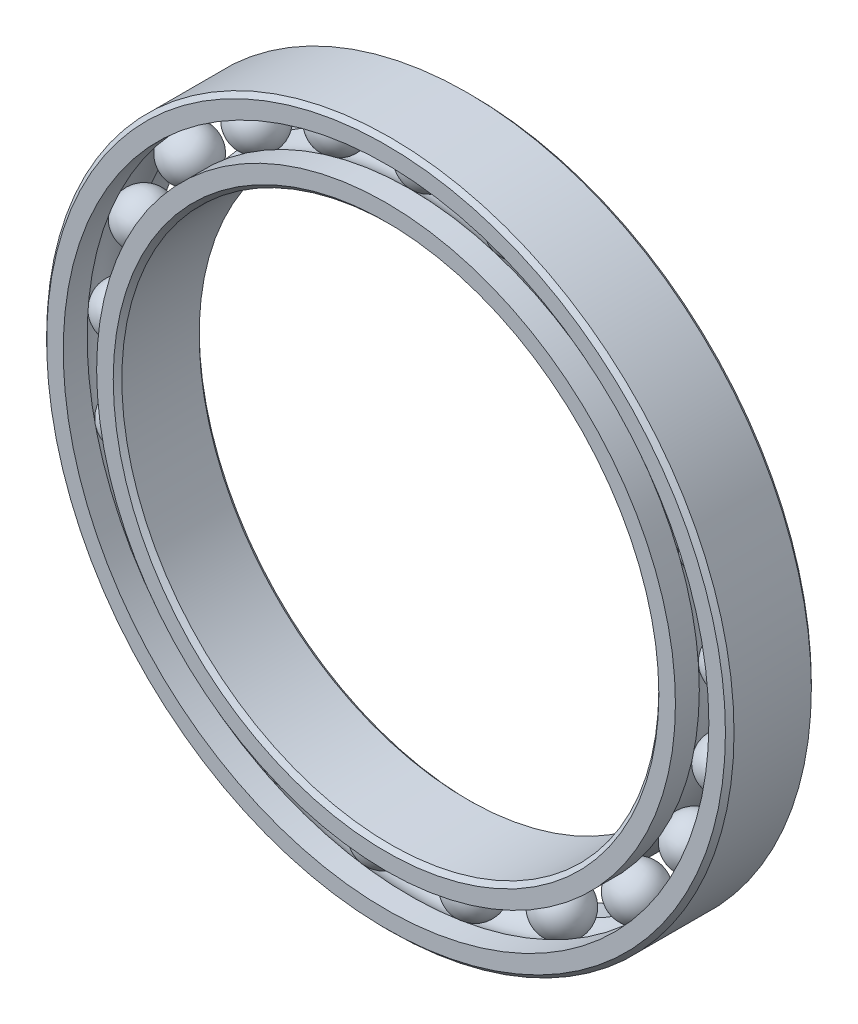
ISO-10303-21;
HEADER;
FILE_DESCRIPTION(('STEP AP214'),'2;1');
FILE_NAME('part.step','',(''),(''),'','','');
FILE_SCHEMA(('AUTOMOTIVE_DESIGN { 1 0 10303 214 1 1 1 1 }'));
ENDSEC;
DATA;
#1=APPLICATION_CONTEXT('core data for automotive mechanical design processes');
#2=APPLICATION_PROTOCOL_DEFINITION('international standard','automotive_design',2000,#1);
#3=PRODUCT_CONTEXT('',#1,'mechanical');
#4=PRODUCT('Part','Part','',(#3));
#5=PRODUCT_RELATED_PRODUCT_CATEGORY('part','',(#4));
#6=PRODUCT_DEFINITION_FORMATION('','',#4);
#7=PRODUCT_DEFINITION_CONTEXT('part definition',#1,'design');
#8=PRODUCT_DEFINITION('design','',#6,#7);
#9=PRODUCT_DEFINITION_SHAPE('','',#8);
#10=(LENGTH_UNIT() NAMED_UNIT(*) SI_UNIT(.MILLI.,.METRE.));
#11=(NAMED_UNIT(*) PLANE_ANGLE_UNIT() SI_UNIT($,.RADIAN.));
#12=(NAMED_UNIT(*) SI_UNIT($,.STERADIAN.) SOLID_ANGLE_UNIT());
#13=UNCERTAINTY_MEASURE_WITH_UNIT(LENGTH_MEASURE(1.E-05),#10,'distance_accuracy_value','');
#14=(GEOMETRIC_REPRESENTATION_CONTEXT(3) GLOBAL_UNCERTAINTY_ASSIGNED_CONTEXT((#13)) GLOBAL_UNIT_ASSIGNED_CONTEXT((#10,
#11,#12)) REPRESENTATION_CONTEXT('',''));
#15=CARTESIAN_POINT('',(0.,0.,0.));
#16=DIRECTION('',(0.,0.,1.));
#17=DIRECTION('',(1.,0.,0.));
#18=AXIS2_PLACEMENT_3D('',#15,#16,#17);
#19=CARTESIAN_POINT('',(4.2002612353552,13.6169124824526,0.));
#20=DIRECTION('',(0.,0.,1.));
#21=DIRECTION('',(0.294755174410891,0.955572805786145,0.));
#22=AXIS2_PLACEMENT_3D('',#19,#20,#21);
#23=SPHERICAL_SURFACE('',#22,1.18112731252607);
#24=CARTESIAN_POINT('',(4.2002612353552,13.6169124824526,1.18112731252607));
#25=VERTEX_POINT('',#24);
#26=VERTEX_LOOP('',#25);
#27=FACE_BOUND('',#26,.T.);
#28=ADVANCED_FACE('F42',(#27),#23,.T.);
#29=CLOSED_SHELL('',(#28));
#30=MANIFOLD_SOLID_BREP('B2',#29);
#31=CARTESIAN_POINT('',(8.02731082740647,11.773902534003,0.));
#32=DIRECTION('',(0.,0.,1.));
#33=DIRECTION('',(0.563320058063612,0.826238774316002,0.));
#34=AXIS2_PLACEMENT_3D('',#31,#32,#33);
#35=SPHERICAL_SURFACE('',#34,1.18112731252607);
#36=CARTESIAN_POINT('',(8.02731082740647,11.773902534003,1.18112731252607));
#37=VERTEX_POINT('',#36);
#38=VERTEX_LOOP('',#37);
#39=FACE_BOUND('',#38,.T.);
#40=ADVANCED_FACE('F61',(#39),#35,.T.);
#41=CLOSED_SHELL('',(#40));
#42=MANIFOLD_SOLID_BREP('B6',#41);
#43=CARTESIAN_POINT('',(11.1410986251693,8.88472967648709,0.));
#44=DIRECTION('',(0.,0.,1.));
#45=DIRECTION('',(0.781831482468022,0.623489801858743,0.));
#46=AXIS2_PLACEMENT_3D('',#43,#44,#45);
#47=SPHERICAL_SURFACE('',#46,1.18112731252607);
#48=CARTESIAN_POINT('',(11.1410986251693,8.88472967648709,1.18112731252607));
#49=VERTEX_POINT('',#48);
#50=VERTEX_LOOP('',#49);
#51=FACE_BOUND('',#50,.T.);
#52=ADVANCED_FACE('F80',(#51),#47,.T.);
#53=CLOSED_SHELL('',(#52));
#54=MANIFOLD_SOLID_BREP('B38',#53);
#55=CARTESIAN_POINT('',(13.2649509181799,5.20610959722128,0.));
#56=DIRECTION('',(0.,0.,1.));
#57=DIRECTION('',(0.9308737486442,0.365341024366405,0.));
#58=AXIS2_PLACEMENT_3D('',#55,#56,#57);
#59=SPHERICAL_SURFACE('',#58,1.18112731252607);
#60=CARTESIAN_POINT('',(13.2649509181799,5.20610959722128,1.18112731252607));
#61=VERTEX_POINT('',#60);
#62=VERTEX_LOOP('',#61);
#63=FACE_BOUND('',#62,.T.);
#64=ADVANCED_FACE('F99',(#63),#59,.T.);
#65=CLOSED_SHELL('',(#64));
#66=MANIFOLD_SOLID_BREP('B57',#65);
#67=CARTESIAN_POINT('',(14.2101541098318,1.0649038336067,0.));
#68=DIRECTION('',(0.,0.,1.));
#69=DIRECTION('',(0.997203797181179,0.074730093586435,0.));
#70=AXIS2_PLACEMENT_3D('',#67,#68,#69);
#71=SPHERICAL_SURFACE('',#70,1.18112731252607);
#72=CARTESIAN_POINT('',(14.2101541098318,1.0649038336067,1.18112731252607));
#73=VERTEX_POINT('',#72);
#74=VERTEX_LOOP('',#73);
#75=FACE_BOUND('',#74,.T.);
#76=ADVANCED_FACE('F120',(#75),#71,.T.);
#77=CLOSED_SHELL('',(#76));
#78=MANIFOLD_SOLID_BREP('B76',#77);
#79=CARTESIAN_POINT('',(13.892722748591,-3.17092330887733,0.));
#80=DIRECTION('',(0.,0.,1.));
#81=DIRECTION('',(0.974927912181826,-0.222520933956304,0.));
#82=AXIS2_PLACEMENT_3D('',#79,#80,#81);
#83=SPHERICAL_SURFACE('',#82,1.18112731252607);
#84=CARTESIAN_POINT('',(13.892722748591,-3.17092330887733,1.18112731252607));
#85=VERTEX_POINT('',#84);
#86=VERTEX_LOOP('',#85);
#87=FACE_BOUND('',#86,.T.);
#88=ADVANCED_FACE('F141',(#87),#83,.T.);
#89=CLOSED_SHELL('',(#88));
#90=MANIFOLD_SOLID_BREP('B95',#89);
#91=CARTESIAN_POINT('',(12.3408620039283,-7.12499999999989,0.));
#92=DIRECTION('',(0.,0.,1.));
#93=DIRECTION('',(0.866025403784443,-0.499999999999992,0.));
#94=AXIS2_PLACEMENT_3D('',#91,#92,#93);
#95=SPHERICAL_SURFACE('',#94,1.18112731252607);
#96=CARTESIAN_POINT('',(12.3408620039283,-7.12499999999989,1.18112731252607));
#97=VERTEX_POINT('',#96);
#98=VERTEX_LOOP('',#97);
#99=FACE_BOUND('',#98,.T.);
#100=ADVANCED_FACE('F162',(#99),#95,.T.);
#101=CLOSED_SHELL('',(#100));
#102=MANIFOLD_SOLID_BREP('B116',#101);
#103=CARTESIAN_POINT('',(9.69246151323569,-10.4459891735749,0.));
#104=DIRECTION('',(0.,0.,1.));
#105=DIRECTION('',(0.680172737770926,-0.73305187182982,0.));
#106=AXIS2_PLACEMENT_3D('',#103,#104,#105);
#107=SPHERICAL_SURFACE('',#106,1.18112731252607);
#108=CARTESIAN_POINT('',(9.69246151323569,-10.4459891735749,1.18112731252607));
#109=VERTEX_POINT('',#108);
#110=VERTEX_LOOP('',#109);
#111=FACE_BOUND('',#110,.T.);
#112=ADVANCED_FACE('F183',(#111),#107,.T.);
#113=CLOSED_SHELL('',(#112));
#114=MANIFOLD_SOLID_BREP('B137',#113);
#115=CARTESIAN_POINT('',(6.1828432824253,-12.8388063676094,0.));
#116=DIRECTION('',(0.,0.,1.));
#117=DIRECTION('',(0.433883739117565,-0.900968867902416,0.));
#118=AXIS2_PLACEMENT_3D('',#115,#116,#117);
#119=SPHERICAL_SURFACE('',#118,1.18112731252607);
#120=CARTESIAN_POINT('',(6.1828432824253,-12.8388063676094,1.18112731252607));
#121=VERTEX_POINT('',#120);
#122=VERTEX_LOOP('',#121);
#123=FACE_BOUND('',#122,.T.);
#124=ADVANCED_FACE('F204',(#123),#119,.T.);
#125=CLOSED_SHELL('',(#124));
#126=MANIFOLD_SOLID_BREP('B158',#125);
#127=CARTESIAN_POINT('',(2.12385229301059,-14.0908392737081,0.));
#128=DIRECTION('',(0.,0.,1.));
#129=DIRECTION('',(0.149042266176182,-0.988830826225127,0.));
#130=AXIS2_PLACEMENT_3D('',#127,#128,#129);
#131=SPHERICAL_SURFACE('',#130,1.18112731252607);
#132=CARTESIAN_POINT('',(2.12385229301059,-14.0908392737081,1.18112731252607));
#133=VERTEX_POINT('',#132);
#134=VERTEX_LOOP('',#133);
#135=FACE_BOUND('',#134,.T.);
#136=ADVANCED_FACE('F225',(#135),#131,.T.);
#137=CLOSED_SHELL('',(#136));
#138=MANIFOLD_SOLID_BREP('B179',#137);
#139=CARTESIAN_POINT('',(-2.12385229301039,-14.0908392737081,0.));
#140=DIRECTION('',(0.,0.,1.));
#141=DIRECTION('',(-0.149042266176168,-0.98883082622513,0.));
#142=AXIS2_PLACEMENT_3D('',#139,#140,#141);
#143=SPHERICAL_SURFACE('',#142,1.18112731252607);
#144=CARTESIAN_POINT('',(-2.12385229301039,-14.0908392737081,1.18112731252607));
#145=VERTEX_POINT('',#144);
#146=VERTEX_LOOP('',#145);
#147=FACE_BOUND('',#146,.T.);
#148=ADVANCED_FACE('F246',(#147),#143,.T.);
#149=CLOSED_SHELL('',(#148));
#150=MANIFOLD_SOLID_BREP('B200',#149);
#151=CARTESIAN_POINT('',(-6.18284328242513,-12.8388063676095,0.));
#152=DIRECTION('',(0.,0.,1.));
#153=DIRECTION('',(-0.433883739117553,-0.900968867902422,0.));
#154=AXIS2_PLACEMENT_3D('',#151,#152,#153);
#155=SPHERICAL_SURFACE('',#154,1.18112731252607);
#156=CARTESIAN_POINT('',(-6.18284328242513,-12.8388063676095,1.18112731252607));
#157=VERTEX_POINT('',#156);
#158=VERTEX_LOOP('',#157);
#159=FACE_BOUND('',#158,.T.);
#160=ADVANCED_FACE('F267',(#159),#155,.T.);
#161=CLOSED_SHELL('',(#160));
#162=MANIFOLD_SOLID_BREP('B221',#161);
#163=CARTESIAN_POINT('',(-9.69246151323555,-10.4459891735751,0.));
#164=DIRECTION('',(0.,0.,1.));
#165=DIRECTION('',(-0.680172737770915,-0.73305187182983,0.));
#166=AXIS2_PLACEMENT_3D('',#163,#164,#165);
#167=SPHERICAL_SURFACE('',#166,1.18112731252607);
#168=CARTESIAN_POINT('',(-9.69246151323555,-10.4459891735751,1.18112731252607));
#169=VERTEX_POINT('',#168);
#170=VERTEX_LOOP('',#169);
#171=FACE_BOUND('',#170,.T.);
#172=ADVANCED_FACE('F288',(#171),#167,.T.);
#173=CLOSED_SHELL('',(#172));
#174=MANIFOLD_SOLID_BREP('B242',#173);
#175=CARTESIAN_POINT('',(-12.3408620039282,-7.12500000000006,0.));
#176=DIRECTION('',(0.,0.,1.));
#177=DIRECTION('',(-0.866025403784436,-0.500000000000004,0.));
#178=AXIS2_PLACEMENT_3D('',#175,#176,#177);
#179=SPHERICAL_SURFACE('',#178,1.18112731252607);
#180=CARTESIAN_POINT('',(-12.3408620039282,-7.12500000000006,1.18112731252607));
#181=VERTEX_POINT('',#180);
#182=VERTEX_LOOP('',#181);
#183=FACE_BOUND('',#182,.T.);
#184=ADVANCED_FACE('F309',(#183),#179,.T.);
#185=CLOSED_SHELL('',(#184));
#186=MANIFOLD_SOLID_BREP('B263',#185);
#187=CARTESIAN_POINT('',(-13.892722748591,-3.17092330887754,0.));
#188=DIRECTION('',(0.,0.,1.));
#189=DIRECTION('',(-0.974927912181823,-0.222520933956318,0.));
#190=AXIS2_PLACEMENT_3D('',#187,#188,#189);
#191=SPHERICAL_SURFACE('',#190,1.18112731252607);
#192=CARTESIAN_POINT('',(-13.892722748591,-3.17092330887754,1.18112731252607));
#193=VERTEX_POINT('',#192);
#194=VERTEX_LOOP('',#193);
#195=FACE_BOUND('',#194,.T.);
#196=ADVANCED_FACE('F330',(#195),#191,.T.);
#197=CLOSED_SHELL('',(#196));
#198=MANIFOLD_SOLID_BREP('B284',#197);
#199=CARTESIAN_POINT('',(-14.2101541098318,1.0649038336065,0.));
#200=DIRECTION('',(0.,0.,1.));
#201=DIRECTION('',(-0.997203797181181,0.0747300935864209,0.));
#202=AXIS2_PLACEMENT_3D('',#199,#200,#201);
#203=SPHERICAL_SURFACE('',#202,1.18112731252607);
#204=CARTESIAN_POINT('',(-14.2101541098318,1.0649038336065,1.18112731252607));
#205=VERTEX_POINT('',#204);
#206=VERTEX_LOOP('',#205);
#207=FACE_BOUND('',#206,.T.);
#208=ADVANCED_FACE('F351',(#207),#203,.T.);
#209=CLOSED_SHELL('',(#208));
#210=MANIFOLD_SOLID_BREP('B305',#209);
#211=CARTESIAN_POINT('',(-13.2649509181799,5.20610959722109,0.));
#212=DIRECTION('',(0.,0.,1.));
#213=DIRECTION('',(-0.930873748644205,0.365341024366392,0.));
#214=AXIS2_PLACEMENT_3D('',#211,#212,#213);
#215=SPHERICAL_SURFACE('',#214,1.18112731252607);
#216=CARTESIAN_POINT('',(-13.2649509181799,5.20610959722109,1.18112731252607));
#217=VERTEX_POINT('',#216);
#218=VERTEX_LOOP('',#217);
#219=FACE_BOUND('',#218,.T.);
#220=ADVANCED_FACE('F372',(#219),#215,.T.);
#221=CLOSED_SHELL('',(#220));
#222=MANIFOLD_SOLID_BREP('B326',#221);
#223=CARTESIAN_POINT('',(-11.1410986251694,8.88472967648693,0.));
#224=DIRECTION('',(0.,0.,1.));
#225=DIRECTION('',(-0.781831482468031,0.623489801858732,0.));
#226=AXIS2_PLACEMENT_3D('',#223,#224,#225);
#227=SPHERICAL_SURFACE('',#226,1.18112731252607);
#228=CARTESIAN_POINT('',(-11.1410986251694,8.88472967648693,1.18112731252607));
#229=VERTEX_POINT('',#228);
#230=VERTEX_LOOP('',#229);
#231=FACE_BOUND('',#230,.T.);
#232=ADVANCED_FACE('F393',(#231),#227,.T.);
#233=CLOSED_SHELL('',(#232));
#234=MANIFOLD_SOLID_BREP('B347',#233);
#235=CARTESIAN_POINT('',(-8.02731082740663,11.7739025340029,0.));
#236=DIRECTION('',(0.,0.,1.));
#237=DIRECTION('',(-0.563320058063623,0.826238774315994,0.));
#238=AXIS2_PLACEMENT_3D('',#235,#236,#237);
#239=SPHERICAL_SURFACE('',#238,1.18112731252607);
#240=CARTESIAN_POINT('',(-8.02731082740663,11.7739025340029,1.18112731252607));
#241=VERTEX_POINT('',#240);
#242=VERTEX_LOOP('',#241);
#243=FACE_BOUND('',#242,.T.);
#244=ADVANCED_FACE('F414',(#243),#239,.T.);
#245=CLOSED_SHELL('',(#244));
#246=MANIFOLD_SOLID_BREP('B368',#245);
#247=CARTESIAN_POINT('',(-4.20026123535539,13.6169124824525,0.));
#248=DIRECTION('',(0.,0.,1.));
#249=DIRECTION('',(-0.294755174410905,0.955572805786141,0.));
#250=AXIS2_PLACEMENT_3D('',#247,#248,#249);
#251=SPHERICAL_SURFACE('',#250,1.18112731252607);
#252=CARTESIAN_POINT('',(-4.20026123535539,13.6169124824525,1.18112731252607));
#253=VERTEX_POINT('',#252);
#254=VERTEX_LOOP('',#253);
#255=FACE_BOUND('',#254,.T.);
#256=ADVANCED_FACE('F435',(#255),#251,.T.);
#257=CLOSED_SHELL('',(#256));
#258=MANIFOLD_SOLID_BREP('B389',#257);
#259=CARTESIAN_POINT('',(0.,14.25,0.));
#260=DIRECTION('',(0.,0.,1.));
#261=DIRECTION('',(0.,1.,0.));
#262=AXIS2_PLACEMENT_3D('',#259,#260,#261);
#263=SPHERICAL_SURFACE('',#262,1.18112731252607);
#264=CARTESIAN_POINT('',(0.,14.25,1.18112731252607));
#265=VERTEX_POINT('',#264);
#266=VERTEX_LOOP('',#265);
#267=FACE_BOUND('',#266,.T.);
#268=ADVANCED_FACE('F458',(#267),#263,.T.);
#269=CLOSED_SHELL('',(#268));
#270=MANIFOLD_SOLID_BREP('B410',#269);
#271=CARTESIAN_POINT('',(0.,13.4722222222222,2.));
#272=DIRECTION('',(0.,0.,-1.));
#273=DIRECTION('',(-1.,0.,0.));
#274=AXIS2_PLACEMENT_3D('',#271,#272,#273);
#275=PLANE('',#274);
#276=CARTESIAN_POINT('',(0.,0.,2.));
#277=DIRECTION('',(0.,0.,1.));
#278=DIRECTION('',(1.,0.,0.));
#279=AXIS2_PLACEMENT_3D('',#276,#277,#278);
#280=CIRCLE('',#279,12.7);
#281=CARTESIAN_POINT('',(12.7,0.,2.));
#282=VERTEX_POINT('',#281);
#283=EDGE_CURVE('E506',#282,#282,#280,.T.);
#284=ORIENTED_EDGE('',*,*,#283,.F.);
#285=EDGE_LOOP('',(#284));
#286=FACE_BOUND('',#285,.T.);
#287=CARTESIAN_POINT('',(0.,0.,2.));
#288=DIRECTION('',(0.,0.,1.));
#289=DIRECTION('',(1.,0.,0.));
#290=AXIS2_PLACEMENT_3D('',#287,#288,#289);
#291=CIRCLE('',#290,13.4722222222222);
#292=CARTESIAN_POINT('',(13.4722222222222,0.,2.));
#293=VERTEX_POINT('',#292);
#294=EDGE_CURVE('E457',#293,#293,#291,.T.);
#295=ORIENTED_EDGE('',*,*,#294,.T.);
#296=EDGE_LOOP('',(#295));
#297=FACE_BOUND('',#296,.T.);
#298=ADVANCED_FACE('F478',(#286,#297),#275,.F.);
#299=CARTESIAN_POINT('',(0.,0.,2.));
#300=DIRECTION('',(0.,0.,1.));
#301=DIRECTION('',(1.,0.,0.));
#302=AXIS2_PLACEMENT_3D('',#299,#300,#301);
#303=CYLINDRICAL_SURFACE('',#302,13.4722222222222);
#304=ORIENTED_EDGE('',*,*,#294,.F.);
#305=EDGE_LOOP('',(#304));
#306=FACE_BOUND('',#305,.T.);
#307=CARTESIAN_POINT('',(0.,0.,0.88888888888889));
#308=DIRECTION('',(0.,0.,1.));
#309=DIRECTION('',(1.,0.,0.));
#310=AXIS2_PLACEMENT_3D('',#307,#308,#309);
#311=CIRCLE('',#310,13.4722222222222);
#312=CARTESIAN_POINT('',(13.4722222222222,0.,0.88888888888889));
#313=VERTEX_POINT('',#312);
#314=EDGE_CURVE('E484',#313,#313,#311,.T.);
#315=ORIENTED_EDGE('',*,*,#314,.T.);
#316=EDGE_LOOP('',(#315));
#317=FACE_BOUND('',#316,.T.);
#318=ADVANCED_FACE('F513',(#306,#317),#303,.T.);
#319=CARTESIAN_POINT('',(0.,0.,0.));
#320=DIRECTION('',(0.,0.,1.));
#321=DIRECTION('',(1.,0.,0.));
#322=AXIS2_PLACEMENT_3D('',#319,#320,#321);
#323=TOROIDAL_SURFACE('',#322,14.25,1.18112731252607);
#324=ORIENTED_EDGE('',*,*,#314,.F.);
#325=EDGE_LOOP('',(#324));
#326=FACE_BOUND('',#325,.T.);
#327=CARTESIAN_POINT('',(0.,0.,-0.88888888888889));
#328=DIRECTION('',(0.,0.,1.));
#329=DIRECTION('',(1.,0.,0.));
#330=AXIS2_PLACEMENT_3D('',#327,#328,#329);
#331=CIRCLE('',#330,13.4722222222222);
#332=CARTESIAN_POINT('',(13.4722222222222,0.,-0.88888888888889));
#333=VERTEX_POINT('',#332);
#334=EDGE_CURVE('E488',#333,#333,#331,.T.);
#335=ORIENTED_EDGE('',*,*,#334,.T.);
#336=EDGE_LOOP('',(#335));
#337=FACE_BOUND('',#336,.T.);
#338=ADVANCED_FACE('F517',(#326,#337),#323,.F.);
#339=CARTESIAN_POINT('',(0.,0.,2.));
#340=DIRECTION('',(0.,0.,1.));
#341=DIRECTION('',(1.,0.,0.));
#342=AXIS2_PLACEMENT_3D('',#339,#340,#341);
#343=CYLINDRICAL_SURFACE('',#342,13.4722222222222);
#344=ORIENTED_EDGE('',*,*,#334,.F.);
#345=EDGE_LOOP('',(#344));
#346=FACE_BOUND('',#345,.T.);
#347=CARTESIAN_POINT('',(0.,0.,-2.));
#348=DIRECTION('',(0.,0.,1.));
#349=DIRECTION('',(1.,0.,0.));
#350=AXIS2_PLACEMENT_3D('',#347,#348,#349);
#351=CIRCLE('',#350,13.4722222222222);
#352=CARTESIAN_POINT('',(13.4722222222222,0.,-2.));
#353=VERTEX_POINT('',#352);
#354=EDGE_CURVE('E492',#353,#353,#351,.T.);
#355=ORIENTED_EDGE('',*,*,#354,.T.);
#356=EDGE_LOOP('',(#355));
#357=FACE_BOUND('',#356,.T.);
#358=ADVANCED_FACE('F522',(#346,#357),#343,.T.);
#359=CARTESIAN_POINT('',(0.,12.7,-2.));
#360=DIRECTION('',(0.,0.,1.));
#361=DIRECTION('',(1.,0.,0.));
#362=AXIS2_PLACEMENT_3D('',#359,#360,#361);
#363=PLANE('',#362);
#364=ORIENTED_EDGE('',*,*,#354,.F.);
#365=EDGE_LOOP('',(#364));
#366=FACE_BOUND('',#365,.T.);
#367=CARTESIAN_POINT('',(0.,0.,-2.));
#368=DIRECTION('',(0.,0.,1.));
#369=DIRECTION('',(1.,0.,0.));
#370=AXIS2_PLACEMENT_3D('',#367,#368,#369);
#371=CIRCLE('',#370,12.7);
#372=CARTESIAN_POINT('',(12.7,0.,-2.));
#373=VERTEX_POINT('',#372);
#374=EDGE_CURVE('E497',#373,#373,#371,.T.);
#375=ORIENTED_EDGE('',*,*,#374,.T.);
#376=EDGE_LOOP('',(#375));
#377=FACE_BOUND('',#376,.T.);
#378=ADVANCED_FACE('F528',(#366,#377),#363,.F.);
#379=CARTESIAN_POINT('',(0.,0.,-1.8));
#380=DIRECTION('',(0.,0.,-1.));
#381=DIRECTION('',(-1.,0.,0.));
#382=AXIS2_PLACEMENT_3D('',#379,#380,#381);
#383=CONICAL_SURFACE('',#382,12.5,0.785398163397453);
#384=ORIENTED_EDGE('',*,*,#374,.F.);
#385=EDGE_LOOP('',(#384));
#386=FACE_BOUND('',#385,.T.);
#387=CARTESIAN_POINT('',(0.,0.,-1.8));
#388=DIRECTION('',(0.,0.,1.));
#389=DIRECTION('',(1.,0.,0.));
#390=AXIS2_PLACEMENT_3D('',#387,#388,#389);
#391=CIRCLE('',#390,12.5);
#392=CARTESIAN_POINT('',(12.5,0.,-1.8));
#393=VERTEX_POINT('',#392);
#394=EDGE_CURVE('E500',#393,#393,#391,.T.);
#395=ORIENTED_EDGE('',*,*,#394,.T.);
#396=EDGE_LOOP('',(#395));
#397=FACE_BOUND('',#396,.T.);
#398=ADVANCED_FACE('F532',(#386,#397),#383,.F.);
#399=CARTESIAN_POINT('',(0.,0.,2.));
#400=DIRECTION('',(0.,0.,1.));
#401=DIRECTION('',(1.,0.,0.));
#402=AXIS2_PLACEMENT_3D('',#399,#400,#401);
#403=CYLINDRICAL_SURFACE('',#402,12.5);
#404=ORIENTED_EDGE('',*,*,#394,.F.);
#405=EDGE_LOOP('',(#404));
#406=FACE_BOUND('',#405,.T.);
#407=CARTESIAN_POINT('',(0.,0.,1.8));
#408=DIRECTION('',(0.,0.,1.));
#409=DIRECTION('',(1.,0.,0.));
#410=AXIS2_PLACEMENT_3D('',#407,#408,#409);
#411=CIRCLE('',#410,12.5);
#412=CARTESIAN_POINT('',(12.5,0.,1.8));
#413=VERTEX_POINT('',#412);
#414=EDGE_CURVE('E503',#413,#413,#411,.T.);
#415=ORIENTED_EDGE('',*,*,#414,.T.);
#416=EDGE_LOOP('',(#415));
#417=FACE_BOUND('',#416,.T.);
#418=ADVANCED_FACE('F536',(#406,#417),#403,.F.);
#419=CARTESIAN_POINT('',(0.,0.,2.));
#420=DIRECTION('',(0.,0.,1.));
#421=DIRECTION('',(1.,0.,0.));
#422=AXIS2_PLACEMENT_3D('',#419,#420,#421);
#423=CONICAL_SURFACE('',#422,12.7,0.785398163397446);
#424=ORIENTED_EDGE('',*,*,#414,.F.);
#425=EDGE_LOOP('',(#424));
#426=FACE_BOUND('',#425,.T.);
#427=ORIENTED_EDGE('',*,*,#283,.T.);
#428=EDGE_LOOP('',(#427));
#429=FACE_BOUND('',#428,.T.);
#430=ADVANCED_FACE('F510',(#426,#429),#423,.F.);
#431=CLOSED_SHELL('',(#298,#318,#338,#358,#378,#398,#418,#430));
#432=MANIFOLD_SOLID_BREP('B431',#431);
#433=CARTESIAN_POINT('',(0.,0.,1.8));
#434=DIRECTION('',(0.,0.,-1.));
#435=DIRECTION('',(-1.,0.,0.));
#436=AXIS2_PLACEMENT_3D('',#433,#434,#435);
#437=CONICAL_SURFACE('',#436,16.,0.785398163397444);
#438=CARTESIAN_POINT('',(0.,0.,2.));
#439=DIRECTION('',(0.,0.,1.));
#440=DIRECTION('',(1.,0.,0.));
#441=AXIS2_PLACEMENT_3D('',#438,#439,#440);
#442=CIRCLE('',#441,15.8);
#443=CARTESIAN_POINT('',(15.8,0.,2.));
#444=VERTEX_POINT('',#443);
#445=EDGE_CURVE('E628',#444,#444,#442,.T.);
#446=ORIENTED_EDGE('',*,*,#445,.F.);
#447=EDGE_LOOP('',(#446));
#448=FACE_BOUND('',#447,.T.);
#449=CARTESIAN_POINT('',(0.,0.,1.8));
#450=DIRECTION('',(0.,0.,1.));
#451=DIRECTION('',(1.,0.,0.));
#452=AXIS2_PLACEMENT_3D('',#449,#450,#451);
#453=CIRCLE('',#452,16.);
#454=CARTESIAN_POINT('',(16.,0.,1.8));
#455=VERTEX_POINT('',#454);
#456=EDGE_CURVE('E477',#455,#455,#453,.T.);
#457=ORIENTED_EDGE('',*,*,#456,.T.);
#458=EDGE_LOOP('',(#457));
#459=FACE_BOUND('',#458,.T.);
#460=ADVANCED_FACE('F600',(#448,#459),#437,.T.);
#461=CARTESIAN_POINT('',(0.,0.,2.));
#462=DIRECTION('',(0.,0.,1.));
#463=DIRECTION('',(1.,0.,0.));
#464=AXIS2_PLACEMENT_3D('',#461,#462,#463);
#465=CYLINDRICAL_SURFACE('',#464,16.);
#466=ORIENTED_EDGE('',*,*,#456,.F.);
#467=EDGE_LOOP('',(#466));
#468=FACE_BOUND('',#467,.T.);
#469=CARTESIAN_POINT('',(0.,0.,-1.8));
#470=DIRECTION('',(0.,0.,1.));
#471=DIRECTION('',(1.,0.,0.));
#472=AXIS2_PLACEMENT_3D('',#469,#470,#471);
#473=CIRCLE('',#472,16.);
#474=CARTESIAN_POINT('',(16.,0.,-1.8));
#475=VERTEX_POINT('',#474);
#476=EDGE_CURVE('E606',#475,#475,#473,.T.);
#477=ORIENTED_EDGE('',*,*,#476,.T.);
#478=EDGE_LOOP('',(#477));
#479=FACE_BOUND('',#478,.T.);
#480=ADVANCED_FACE('F635',(#468,#479),#465,.T.);
#481=CARTESIAN_POINT('',(0.,0.,-2.));
#482=DIRECTION('',(0.,0.,1.));
#483=DIRECTION('',(1.,0.,0.));
#484=AXIS2_PLACEMENT_3D('',#481,#482,#483);
#485=CONICAL_SURFACE('',#484,15.8,0.785398163397444);
#486=ORIENTED_EDGE('',*,*,#476,.F.);
#487=EDGE_LOOP('',(#486));
#488=FACE_BOUND('',#487,.T.);
#489=CARTESIAN_POINT('',(0.,0.,-2.));
#490=DIRECTION('',(0.,0.,1.));
#491=DIRECTION('',(1.,0.,0.));
#492=AXIS2_PLACEMENT_3D('',#489,#490,#491);
#493=CIRCLE('',#492,15.8);
#494=CARTESIAN_POINT('',(15.8,0.,-2.));
#495=VERTEX_POINT('',#494);
#496=EDGE_CURVE('E610',#495,#495,#493,.T.);
#497=ORIENTED_EDGE('',*,*,#496,.T.);
#498=EDGE_LOOP('',(#497));
#499=FACE_BOUND('',#498,.T.);
#500=ADVANCED_FACE('F639',(#488,#499),#485,.T.);
#501=CARTESIAN_POINT('',(0.,15.8,-2.));
#502=DIRECTION('',(0.,0.,1.));
#503=DIRECTION('',(1.,0.,0.));
#504=AXIS2_PLACEMENT_3D('',#501,#502,#503);
#505=PLANE('',#504);
#506=ORIENTED_EDGE('',*,*,#496,.F.);
#507=EDGE_LOOP('',(#506));
#508=FACE_BOUND('',#507,.T.);
#509=CARTESIAN_POINT('',(0.,0.,-2.));
#510=DIRECTION('',(0.,0.,1.));
#511=DIRECTION('',(1.,0.,0.));
#512=AXIS2_PLACEMENT_3D('',#509,#510,#511);
#513=CIRCLE('',#512,15.0277777777778);
#514=CARTESIAN_POINT('',(15.0277777777778,0.,-2.));
#515=VERTEX_POINT('',#514);
#516=EDGE_CURVE('E614',#515,#515,#513,.T.);
#517=ORIENTED_EDGE('',*,*,#516,.T.);
#518=EDGE_LOOP('',(#517));
#519=FACE_BOUND('',#518,.T.);
#520=ADVANCED_FACE('F644',(#508,#519),#505,.F.);
#521=CARTESIAN_POINT('',(0.,0.,2.));
#522=DIRECTION('',(0.,0.,1.));
#523=DIRECTION('',(1.,0.,0.));
#524=AXIS2_PLACEMENT_3D('',#521,#522,#523);
#525=CYLINDRICAL_SURFACE('',#524,15.0277777777778);
#526=ORIENTED_EDGE('',*,*,#516,.F.);
#527=EDGE_LOOP('',(#526));
#528=FACE_BOUND('',#527,.T.);
#529=CARTESIAN_POINT('',(0.,0.,-0.888888888888889));
#530=DIRECTION('',(0.,0.,1.));
#531=DIRECTION('',(1.,0.,0.));
#532=AXIS2_PLACEMENT_3D('',#529,#530,#531);
#533=CIRCLE('',#532,15.0277777777778);
#534=CARTESIAN_POINT('',(15.0277777777778,0.,-0.888888888888889));
#535=VERTEX_POINT('',#534);
#536=EDGE_CURVE('E619',#535,#535,#533,.T.);
#537=ORIENTED_EDGE('',*,*,#536,.T.);
#538=EDGE_LOOP('',(#537));
#539=FACE_BOUND('',#538,.T.);
#540=ADVANCED_FACE('F650',(#528,#539),#525,.F.);
#541=CARTESIAN_POINT('',(0.,0.,0.));
#542=DIRECTION('',(0.,0.,1.));
#543=DIRECTION('',(1.,0.,0.));
#544=AXIS2_PLACEMENT_3D('',#541,#542,#543);
#545=TOROIDAL_SURFACE('',#544,14.25,1.18112731252607);
#546=ORIENTED_EDGE('',*,*,#536,.F.);
#547=EDGE_LOOP('',(#546));
#548=FACE_BOUND('',#547,.T.);
#549=CARTESIAN_POINT('',(0.,0.,0.888888888888889));
#550=DIRECTION('',(0.,0.,1.));
#551=DIRECTION('',(1.,0.,0.));
#552=AXIS2_PLACEMENT_3D('',#549,#550,#551);
#553=CIRCLE('',#552,15.0277777777778);
#554=CARTESIAN_POINT('',(15.0277777777778,0.,0.888888888888889));
#555=VERTEX_POINT('',#554);
#556=EDGE_CURVE('E622',#555,#555,#553,.T.);
#557=ORIENTED_EDGE('',*,*,#556,.T.);
#558=EDGE_LOOP('',(#557));
#559=FACE_BOUND('',#558,.T.);
#560=ADVANCED_FACE('F654',(#548,#559),#545,.F.);
#561=CARTESIAN_POINT('',(0.,0.,2.));
#562=DIRECTION('',(0.,0.,1.));
#563=DIRECTION('',(1.,0.,0.));
#564=AXIS2_PLACEMENT_3D('',#561,#562,#563);
#565=CYLINDRICAL_SURFACE('',#564,15.0277777777778);
#566=ORIENTED_EDGE('',*,*,#556,.F.);
#567=EDGE_LOOP('',(#566));
#568=FACE_BOUND('',#567,.T.);
#569=CARTESIAN_POINT('',(0.,0.,2.));
#570=DIRECTION('',(0.,0.,1.));
#571=DIRECTION('',(1.,0.,0.));
#572=AXIS2_PLACEMENT_3D('',#569,#570,#571);
#573=CIRCLE('',#572,15.0277777777778);
#574=CARTESIAN_POINT('',(15.0277777777778,0.,2.));
#575=VERTEX_POINT('',#574);
#576=EDGE_CURVE('E625',#575,#575,#573,.T.);
#577=ORIENTED_EDGE('',*,*,#576,.T.);
#578=EDGE_LOOP('',(#577));
#579=FACE_BOUND('',#578,.T.);
#580=ADVANCED_FACE('F658',(#568,#579),#565,.F.);
#581=CARTESIAN_POINT('',(0.,15.8,2.));
#582=DIRECTION('',(0.,0.,-1.));
#583=DIRECTION('',(-1.,0.,0.));
#584=AXIS2_PLACEMENT_3D('',#581,#582,#583);
#585=PLANE('',#584);
#586=ORIENTED_EDGE('',*,*,#576,.F.);
#587=EDGE_LOOP('',(#586));
#588=FACE_BOUND('',#587,.T.);
#589=ORIENTED_EDGE('',*,*,#445,.T.);
#590=EDGE_LOOP('',(#589));
#591=FACE_BOUND('',#590,.T.);
#592=ADVANCED_FACE('F632',(#588,#591),#585,.F.);
#593=CLOSED_SHELL('',(#460,#480,#500,#520,#540,#560,#580,#592));
#594=MANIFOLD_SOLID_BREP('B452',#593);
#595=ADVANCED_BREP_SHAPE_REPRESENTATION('',(#18,#30,#42,#54,#66,#78,#90,#102,#114,#126,#138,
#150,#162,#174,#186,#198,#210,#222,#234,#246,#258,#270,#432,#594),#14);
#596=SHAPE_DEFINITION_REPRESENTATION(#9,#595);
ENDSEC;
END-ISO-10303-21;
